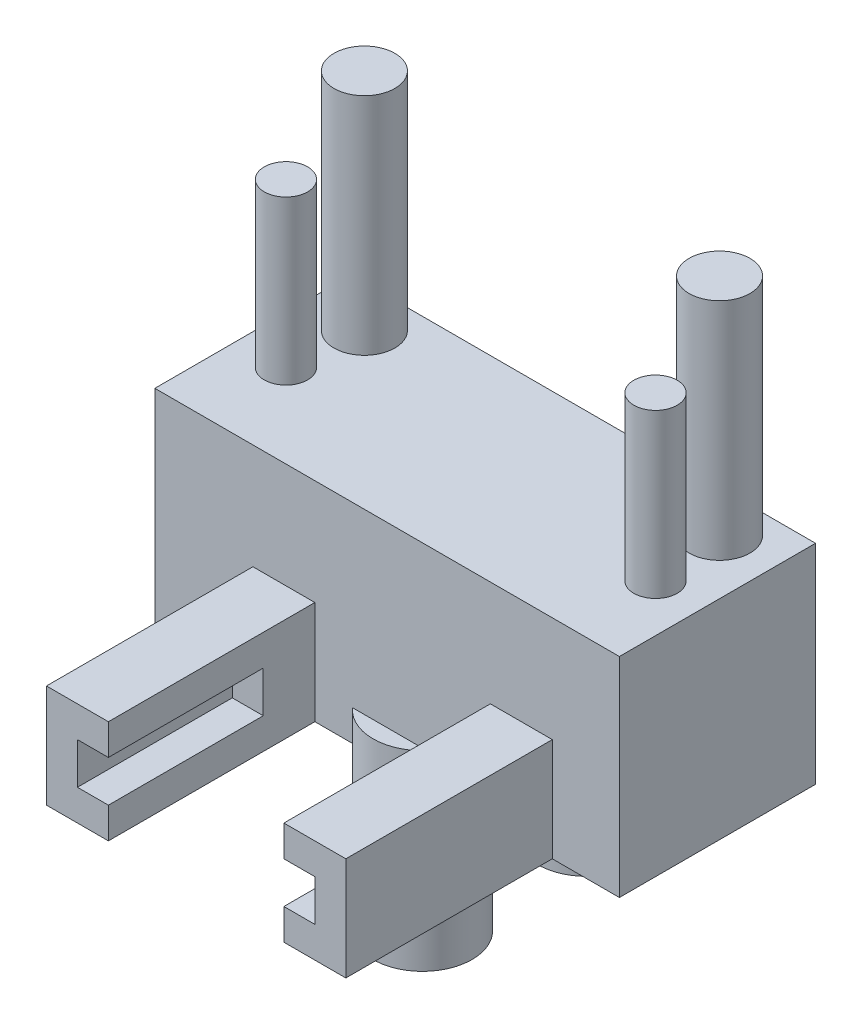
ISO-10303-21;
HEADER;
FILE_DESCRIPTION(('STEP AP214'),'2;1');
FILE_NAME('part.step','',(''),(''),'','','');
FILE_SCHEMA(('AUTOMOTIVE_DESIGN { 1 0 10303 214 1 1 1 1 }'));
ENDSEC;
DATA;
#1=APPLICATION_CONTEXT('core data for automotive mechanical design processes');
#2=APPLICATION_PROTOCOL_DEFINITION('international standard','automotive_design',2000,#1);
#3=PRODUCT_CONTEXT('',#1,'mechanical');
#4=PRODUCT('Part','Part','',(#3));
#5=PRODUCT_RELATED_PRODUCT_CATEGORY('part','',(#4));
#6=PRODUCT_DEFINITION_FORMATION('','',#4);
#7=PRODUCT_DEFINITION_CONTEXT('part definition',#1,'design');
#8=PRODUCT_DEFINITION('design','',#6,#7);
#9=PRODUCT_DEFINITION_SHAPE('','',#8);
#10=(LENGTH_UNIT() NAMED_UNIT(*) SI_UNIT(.MILLI.,.METRE.));
#11=(NAMED_UNIT(*) PLANE_ANGLE_UNIT() SI_UNIT($,.RADIAN.));
#12=(NAMED_UNIT(*) SI_UNIT($,.STERADIAN.) SOLID_ANGLE_UNIT());
#13=UNCERTAINTY_MEASURE_WITH_UNIT(LENGTH_MEASURE(1.E-05),#10,'distance_accuracy_value','');
#14=(GEOMETRIC_REPRESENTATION_CONTEXT(3) GLOBAL_UNCERTAINTY_ASSIGNED_CONTEXT((#13)) GLOBAL_UNIT_ASSIGNED_CONTEXT((#10,
#11,#12)) REPRESENTATION_CONTEXT('',''));
#15=CARTESIAN_POINT('',(0.,0.,0.));
#16=DIRECTION('',(0.,0.,1.));
#17=DIRECTION('',(1.,0.,0.));
#18=AXIS2_PLACEMENT_3D('',#15,#16,#17);
#19=CARTESIAN_POINT('',(-40.1857896698205,1.5,24.5794807115573));
#20=DIRECTION('',(1.,0.,0.));
#21=DIRECTION('',(0.,0.,-1.));
#22=AXIS2_PLACEMENT_3D('',#19,#20,#21);
#23=PLANE('',#22);
#24=DIRECTION('',(0.,-1.,0.));
#25=VECTOR('',#24,1.);
#26=CARTESIAN_POINT('',(-40.1857896698205,1.5,17.5794807115573));
#27=LINE('',#26,#25);
#28=CARTESIAN_POINT('',(-40.1857896698205,4.11,17.5794807115573));
#29=VERTEX_POINT('',#28);
#30=CARTESIAN_POINT('',(-40.1857896698205,-6.,17.5794807115573));
#31=VERTEX_POINT('',#30);
#32=EDGE_CURVE('E230',#29,#31,#27,.T.);
#33=ORIENTED_EDGE('',*,*,#32,.T.);
#34=DIRECTION('',(0.,0.,1.));
#35=VECTOR('',#34,1.);
#36=CARTESIAN_POINT('',(-40.1857896698205,-6.,0.));
#37=LINE('',#36,#35);
#38=CARTESIAN_POINT('',(-40.1857896698205,-6.,27.0794807115573));
#39=VERTEX_POINT('',#38);
#40=EDGE_CURVE('E199',#31,#39,#37,.T.);
#41=ORIENTED_EDGE('',*,*,#40,.T.);
#42=DIRECTION('',(0.,-1.,0.));
#43=VECTOR('',#42,1.);
#44=CARTESIAN_POINT('',(-40.1857896698205,1.5,27.0794807115573));
#45=LINE('',#44,#43);
#46=CARTESIAN_POINT('',(-40.1857896698205,4.11,27.0794807115573));
#47=VERTEX_POINT('',#46);
#48=EDGE_CURVE('E244',#47,#39,#45,.T.);
#49=ORIENTED_EDGE('',*,*,#48,.F.);
#50=DIRECTION('',(0.,0.,1.));
#51=VECTOR('',#50,1.);
#52=CARTESIAN_POINT('',(-40.1857896698205,4.11,17.5794807115573));
#53=LINE('',#52,#51);
#54=EDGE_CURVE('E384',#29,#47,#53,.T.);
#55=ORIENTED_EDGE('',*,*,#54,.F.);
#56=EDGE_LOOP('',(#33,#41,#49,#55));
#57=FACE_BOUND('',#56,.T.);
#58=ADVANCED_FACE('F37',(#57),#23,.F.);
#59=CARTESIAN_POINT('',(-17.6857896698205,1.5,24.5794807115573));
#60=DIRECTION('',(-1.,0.,0.));
#61=DIRECTION('',(0.,0.,1.));
#62=AXIS2_PLACEMENT_3D('',#59,#60,#61);
#63=PLANE('',#62);
#64=DIRECTION('',(0.,-1.,0.));
#65=VECTOR('',#64,1.);
#66=CARTESIAN_POINT('',(-17.6857896698205,1.5,17.5794807115573));
#67=LINE('',#66,#65);
#68=CARTESIAN_POINT('',(-17.6857896698205,4.11,17.5794807115573));
#69=VERTEX_POINT('',#68);
#70=CARTESIAN_POINT('',(-17.6857896698205,-6.,17.5794807115573));
#71=VERTEX_POINT('',#70);
#72=EDGE_CURVE('E227',#69,#71,#67,.T.);
#73=ORIENTED_EDGE('',*,*,#72,.F.);
#74=DIRECTION('',(0.,0.,-1.));
#75=VECTOR('',#74,1.);
#76=CARTESIAN_POINT('',(-17.6857896698205,4.11,17.5794807115573));
#77=LINE('',#76,#75);
#78=CARTESIAN_POINT('',(-17.6857896698205,4.11,27.0794807115573));
#79=VERTEX_POINT('',#78);
#80=EDGE_CURVE('E378',#79,#69,#77,.T.);
#81=ORIENTED_EDGE('',*,*,#80,.F.);
#82=DIRECTION('',(0.,-1.,0.));
#83=VECTOR('',#82,1.);
#84=CARTESIAN_POINT('',(-17.6857896698205,1.5,27.0794807115573));
#85=LINE('',#84,#83);
#86=CARTESIAN_POINT('',(-17.6857896698205,-6.,27.0794807115573));
#87=VERTEX_POINT('',#86);
#88=EDGE_CURVE('E245',#79,#87,#85,.T.);
#89=ORIENTED_EDGE('',*,*,#88,.T.);
#90=DIRECTION('',(0.,0.,1.));
#91=VECTOR('',#90,1.);
#92=CARTESIAN_POINT('',(-17.6857896698205,-6.,0.));
#93=LINE('',#92,#91);
#94=EDGE_CURVE('E200',#71,#87,#93,.T.);
#95=ORIENTED_EDGE('',*,*,#94,.F.);
#96=EDGE_LOOP('',(#73,#81,#89,#95));
#97=FACE_BOUND('',#96,.T.);
#98=ADVANCED_FACE('F420',(#97),#63,.F.);
#99=CARTESIAN_POINT('',(-40.1857896698205,1.5,17.5794807115573));
#100=DIRECTION('',(0.,0.,1.));
#101=DIRECTION('',(1.,0.,0.));
#102=AXIS2_PLACEMENT_3D('',#99,#100,#101);
#103=PLANE('',#102);
#104=DIRECTION('',(1.,0.,0.));
#105=VECTOR('',#104,1.);
#106=CARTESIAN_POINT('',(-40.1857896698205,-4.5,17.5794807115573));
#107=LINE('',#106,#105);
#108=CARTESIAN_POINT('',(-31.2100395525964,-4.5,17.5794807115573));
#109=VERTEX_POINT('',#108);
#110=CARTESIAN_POINT('',(-26.4115397870447,-4.5,17.5794807115573));
#111=VERTEX_POINT('',#110);
#112=EDGE_CURVE('E11',#109,#111,#107,.T.);
#113=ORIENTED_EDGE('',*,*,#112,.F.);
#114=DIRECTION('',(0.,-1.,0.));
#115=VECTOR('',#114,1.);
#116=CARTESIAN_POINT('',(-31.2100395525964,-4.5,17.5794807115573));
#117=LINE('',#116,#115);
#118=CARTESIAN_POINT('',(-31.2100395525964,-6.,17.5794807115573));
#119=VERTEX_POINT('',#118);
#120=EDGE_CURVE('E203',#109,#119,#117,.T.);
#121=ORIENTED_EDGE('',*,*,#120,.T.);
#122=DIRECTION('',(1.,0.,0.));
#123=VECTOR('',#122,1.);
#124=CARTESIAN_POINT('',(0.,-6.,17.5794807115573));
#125=LINE('',#124,#123);
#126=EDGE_CURVE('E195',#31,#119,#125,.T.);
#127=ORIENTED_EDGE('',*,*,#126,.F.);
#128=ORIENTED_EDGE('',*,*,#32,.F.);
#129=DIRECTION('',(-1.,0.,0.));
#130=VECTOR('',#129,1.);
#131=CARTESIAN_POINT('',(-40.1857896698205,4.11,17.5794807115573));
#132=LINE('',#131,#130);
#133=EDGE_CURVE('E222',#69,#29,#132,.T.);
#134=ORIENTED_EDGE('',*,*,#133,.F.);
#135=ORIENTED_EDGE('',*,*,#72,.T.);
#136=CARTESIAN_POINT('',(-26.4115397870447,-6.,17.5794807115573));
#137=VERTEX_POINT('',#136);
#138=EDGE_CURVE('E201',#137,#71,#125,.T.);
#139=ORIENTED_EDGE('',*,*,#138,.F.);
#140=DIRECTION('',(0.,-1.,0.));
#141=VECTOR('',#140,1.);
#142=CARTESIAN_POINT('',(-26.4115397870447,-4.5,17.5794807115573));
#143=LINE('',#142,#141);
#144=EDGE_CURVE('E51',#137,#111,#143,.F.);
#145=ORIENTED_EDGE('',*,*,#144,.T.);
#146=EDGE_LOOP('',(#113,#121,#127,#128,#134,#135,#139,#145));
#147=FACE_BOUND('',#146,.T.);
#148=ADVANCED_FACE('F204',(#147),#103,.F.);
#149=CARTESIAN_POINT('',(0.,1.5,27.0794807115573));
#150=DIRECTION('',(0.,0.,1.));
#151=DIRECTION('',(1.,0.,0.));
#152=AXIS2_PLACEMENT_3D('',#149,#150,#151);
#153=PLANE('',#152);
#154=DIRECTION('',(0.,-1.,0.));
#155=VECTOR('',#154,1.);
#156=CARTESIAN_POINT('',(-30.60853826181,-4.5,27.0794807115573));
#157=LINE('',#156,#155);
#158=CARTESIAN_POINT('',(-30.60853826181,-4.5,27.0794807115573));
#159=VERTEX_POINT('',#158);
#160=CARTESIAN_POINT('',(-30.60853826181,-6.,27.0794807115573));
#161=VERTEX_POINT('',#160);
#162=EDGE_CURVE('E387',#159,#161,#157,.T.);
#163=ORIENTED_EDGE('',*,*,#162,.F.);
#164=DIRECTION('',(1.,0.,0.));
#165=VECTOR('',#164,1.);
#166=CARTESIAN_POINT('',(0.,-4.5,27.0794807115573));
#167=LINE('',#166,#165);
#168=CARTESIAN_POINT('',(-27.0130410778311,-4.5,27.0794807115573));
#169=VERTEX_POINT('',#168);
#170=EDGE_CURVE('E211',#159,#169,#167,.T.);
#171=ORIENTED_EDGE('',*,*,#170,.T.);
#172=DIRECTION('',(0.,-1.,0.));
#173=VECTOR('',#172,1.);
#174=CARTESIAN_POINT('',(-27.0130410778311,-4.5,27.0794807115573));
#175=LINE('',#174,#173);
#176=CARTESIAN_POINT('',(-27.0130410778311,-6.,27.0794807115573));
#177=VERTEX_POINT('',#176);
#178=EDGE_CURVE('E390',#177,#169,#175,.F.);
#179=ORIENTED_EDGE('',*,*,#178,.F.);
#180=DIRECTION('',(-1.,0.,0.));
#181=VECTOR('',#180,1.);
#182=CARTESIAN_POINT('',(0.,-6.,27.0794807115573));
#183=LINE('',#182,#181);
#184=CARTESIAN_POINT('',(-23.9357896698205,-6.,27.0794807115573));
#185=VERTEX_POINT('',#184);
#186=EDGE_CURVE('E252',#185,#177,#183,.T.);
#187=ORIENTED_EDGE('',*,*,#186,.F.);
#188=DIRECTION('',(0.,-1.,0.));
#189=VECTOR('',#188,1.);
#190=CARTESIAN_POINT('',(-23.9357896698205,-1.,27.0794807115573));
#191=LINE('',#190,#189);
#192=CARTESIAN_POINT('',(-23.9357896698205,-1.,27.0794807115573));
#193=VERTEX_POINT('',#192);
#194=EDGE_CURVE('E291',#193,#185,#191,.T.);
#195=ORIENTED_EDGE('',*,*,#194,.F.);
#196=DIRECTION('',(1.,0.,0.));
#197=VECTOR('',#196,1.);
#198=CARTESIAN_POINT('',(-23.9357896698205,-1.,27.0794807115573));
#199=LINE('',#198,#197);
#200=CARTESIAN_POINT('',(-20.9357896698205,-1.,27.0794807115573));
#201=VERTEX_POINT('',#200);
#202=EDGE_CURVE('E318',#193,#201,#199,.T.);
#203=ORIENTED_EDGE('',*,*,#202,.T.);
#204=DIRECTION('',(0.,-1.,0.));
#205=VECTOR('',#204,1.);
#206=CARTESIAN_POINT('',(-20.9357896698205,-1.,27.0794807115573));
#207=LINE('',#206,#205);
#208=CARTESIAN_POINT('',(-20.9357896698205,-6.,27.0794807115573));
#209=VERTEX_POINT('',#208);
#210=EDGE_CURVE('E294',#201,#209,#207,.T.);
#211=ORIENTED_EDGE('',*,*,#210,.T.);
#212=EDGE_CURVE('E247',#87,#209,#183,.T.);
#213=ORIENTED_EDGE('',*,*,#212,.F.);
#214=ORIENTED_EDGE('',*,*,#88,.F.);
#215=DIRECTION('',(1.,0.,0.));
#216=VECTOR('',#215,1.);
#217=CARTESIAN_POINT('',(-40.1857896698205,4.11,27.0794807115573));
#218=LINE('',#217,#216);
#219=EDGE_CURVE('E381',#47,#79,#218,.T.);
#220=ORIENTED_EDGE('',*,*,#219,.F.);
#221=ORIENTED_EDGE('',*,*,#48,.T.);
#222=CARTESIAN_POINT('',(-35.4357896698205,-6.,27.0794807115573));
#223=VERTEX_POINT('',#222);
#224=EDGE_CURVE('E254',#223,#39,#183,.T.);
#225=ORIENTED_EDGE('',*,*,#224,.F.);
#226=DIRECTION('',(0.,-1.,0.));
#227=VECTOR('',#226,1.);
#228=CARTESIAN_POINT('',(-35.4357896698205,-1.,27.0794807115573));
#229=LINE('',#228,#227);
#230=CARTESIAN_POINT('',(-35.4357896698205,-1.,27.0794807115573));
#231=VERTEX_POINT('',#230);
#232=EDGE_CURVE('E259',#231,#223,#229,.T.);
#233=ORIENTED_EDGE('',*,*,#232,.F.);
#234=DIRECTION('',(1.,0.,0.));
#235=VECTOR('',#234,1.);
#236=CARTESIAN_POINT('',(-35.4357896698205,-1.,27.0794807115573));
#237=LINE('',#236,#235);
#238=CARTESIAN_POINT('',(-32.4357896698205,-1.,27.0794807115573));
#239=VERTEX_POINT('',#238);
#240=EDGE_CURVE('E286',#231,#239,#237,.T.);
#241=ORIENTED_EDGE('',*,*,#240,.T.);
#242=DIRECTION('',(0.,-1.,0.));
#243=VECTOR('',#242,1.);
#244=CARTESIAN_POINT('',(-32.4357896698205,-1.,27.0794807115573));
#245=LINE('',#244,#243);
#246=CARTESIAN_POINT('',(-32.4357896698205,-6.,27.0794807115573));
#247=VERTEX_POINT('',#246);
#248=EDGE_CURVE('E261',#239,#247,#245,.T.);
#249=ORIENTED_EDGE('',*,*,#248,.T.);
#250=EDGE_CURVE('E253',#161,#247,#183,.T.);
#251=ORIENTED_EDGE('',*,*,#250,.F.);
#252=EDGE_LOOP('',(#163,#171,#179,#187,#195,#203,#211,#213,#214,#220,#221,#225,#233,#241,#249,#251));
#253=FACE_BOUND('',#252,.T.);
#254=ADVANCED_FACE('F435',(#253),#153,.T.);
#255=CARTESIAN_POINT('',(0.,-6.,0.));
#256=DIRECTION('',(0.,-1.,0.));
#257=DIRECTION('',(0.,0.,-1.));
#258=AXIS2_PLACEMENT_3D('',#255,#256,#257);
#259=PLANE('',#258);
#260=CARTESIAN_POINT('',(-28.8107896698205,-6.,17.5194807115573));
#261=DIRECTION('',(0.,-1.,0.));
#262=DIRECTION('',(0.,0.,-1.));
#263=AXIS2_PLACEMENT_3D('',#260,#261,#262);
#264=CIRCLE('',#263,2.4);
#265=EDGE_CURVE('E44',#137,#119,#264,.T.);
#266=ORIENTED_EDGE('',*,*,#265,.F.);
#267=ORIENTED_EDGE('',*,*,#138,.T.);
#268=ORIENTED_EDGE('',*,*,#94,.T.);
#269=ORIENTED_EDGE('',*,*,#212,.T.);
#270=DIRECTION('',(0.,0.,1.));
#271=VECTOR('',#270,1.);
#272=CARTESIAN_POINT('',(-20.9357896698205,-6.,27.0794807115573));
#273=LINE('',#272,#271);
#274=CARTESIAN_POINT('',(-20.9357896698205,-6.,37.0794807115573));
#275=VERTEX_POINT('',#274);
#276=EDGE_CURVE('E307',#209,#275,#273,.T.);
#277=ORIENTED_EDGE('',*,*,#276,.T.);
#278=DIRECTION('',(-1.,0.,0.));
#279=VECTOR('',#278,1.);
#280=CARTESIAN_POINT('',(-23.9357896698205,-6.,37.0794807115573));
#281=LINE('',#280,#279);
#282=CARTESIAN_POINT('',(-23.9357896698205,-6.,37.0794807115573));
#283=VERTEX_POINT('',#282);
#284=EDGE_CURVE('E303',#275,#283,#281,.T.);
#285=ORIENTED_EDGE('',*,*,#284,.T.);
#286=DIRECTION('',(0.,0.,-1.));
#287=VECTOR('',#286,1.);
#288=CARTESIAN_POINT('',(-23.9357896698205,-6.,27.0794807115573));
#289=LINE('',#288,#287);
#290=EDGE_CURVE('E310',#283,#185,#289,.T.);
#291=ORIENTED_EDGE('',*,*,#290,.T.);
#292=ORIENTED_EDGE('',*,*,#186,.T.);
#293=CARTESIAN_POINT('',(-28.8107896698205,-6.,25.4894807115573));
#294=DIRECTION('',(0.,-1.,0.));
#295=DIRECTION('',(0.,0.,-1.));
#296=AXIS2_PLACEMENT_3D('',#293,#294,#295);
#297=CIRCLE('',#296,2.4);
#298=EDGE_CURVE('E212',#161,#177,#297,.T.);
#299=ORIENTED_EDGE('',*,*,#298,.F.);
#300=ORIENTED_EDGE('',*,*,#250,.T.);
#301=DIRECTION('',(0.,0.,1.));
#302=VECTOR('',#301,1.);
#303=CARTESIAN_POINT('',(-32.4357896698205,-6.,27.0794807115573));
#304=LINE('',#303,#302);
#305=CARTESIAN_POINT('',(-32.4357896698205,-6.,37.0794807115573));
#306=VERTEX_POINT('',#305);
#307=EDGE_CURVE('E274',#247,#306,#304,.T.);
#308=ORIENTED_EDGE('',*,*,#307,.T.);
#309=DIRECTION('',(-1.,0.,0.));
#310=VECTOR('',#309,1.);
#311=CARTESIAN_POINT('',(-35.4357896698205,-6.,37.0794807115573));
#312=LINE('',#311,#310);
#313=CARTESIAN_POINT('',(-35.4357896698205,-6.,37.0794807115573));
#314=VERTEX_POINT('',#313);
#315=EDGE_CURVE('E270',#306,#314,#312,.T.);
#316=ORIENTED_EDGE('',*,*,#315,.T.);
#317=DIRECTION('',(0.,0.,-1.));
#318=VECTOR('',#317,1.);
#319=CARTESIAN_POINT('',(-35.4357896698205,-6.,27.0794807115573));
#320=LINE('',#319,#318);
#321=EDGE_CURVE('E277',#314,#223,#320,.T.);
#322=ORIENTED_EDGE('',*,*,#321,.T.);
#323=ORIENTED_EDGE('',*,*,#224,.T.);
#324=ORIENTED_EDGE('',*,*,#40,.F.);
#325=ORIENTED_EDGE('',*,*,#126,.T.);
#326=EDGE_LOOP('',(#266,#267,#268,#269,#277,#285,#291,#292,#299,#300,#308,#316,#322,#323,#324,#325));
#327=FACE_BOUND('',#326,.T.);
#328=ADVANCED_FACE('F196',(#327),#259,.T.);
#329=CARTESIAN_POINT('',(-35.4357896698205,-1.,27.0794807115573));
#330=DIRECTION('',(-1.,0.,0.));
#331=DIRECTION('',(0.,0.,1.));
#332=AXIS2_PLACEMENT_3D('',#329,#330,#331);
#333=PLANE('',#332);
#334=ORIENTED_EDGE('',*,*,#321,.F.);
#335=DIRECTION('',(0.,-1.,0.));
#336=VECTOR('',#335,1.);
#337=CARTESIAN_POINT('',(-35.4357896698205,-1.,37.0794807115573));
#338=LINE('',#337,#336);
#339=CARTESIAN_POINT('',(-35.4357896698205,-1.,37.0794807115573));
#340=VERTEX_POINT('',#339);
#341=EDGE_CURVE('E258',#340,#314,#338,.T.);
#342=ORIENTED_EDGE('',*,*,#341,.F.);
#343=DIRECTION('',(0.,0.,-1.));
#344=VECTOR('',#343,1.);
#345=CARTESIAN_POINT('',(-35.4357896698205,-1.,27.0794807115573));
#346=LINE('',#345,#344);
#347=EDGE_CURVE('E273',#340,#231,#346,.T.);
#348=ORIENTED_EDGE('',*,*,#347,.T.);
#349=ORIENTED_EDGE('',*,*,#232,.T.);
#350=EDGE_LOOP('',(#334,#342,#348,#349));
#351=FACE_BOUND('',#350,.T.);
#352=ADVANCED_FACE('F460',(#351),#333,.T.);
#353=CARTESIAN_POINT('',(-35.4357896698205,-1.,37.0794807115573));
#354=DIRECTION('',(0.,0.,1.));
#355=DIRECTION('',(1.,0.,0.));
#356=AXIS2_PLACEMENT_3D('',#353,#354,#355);
#357=PLANE('',#356);
#358=DIRECTION('',(1.,0.,0.));
#359=VECTOR('',#358,1.);
#360=CARTESIAN_POINT('',(-22.4357896698205,-4.5,37.0794807115573));
#361=LINE('',#360,#359);
#362=CARTESIAN_POINT('',(-33.9357896698205,-4.5,37.0794807115573));
#363=VERTEX_POINT('',#362);
#364=CARTESIAN_POINT('',(-32.4357896698205,-4.5,37.0794807115573));
#365=VERTEX_POINT('',#364);
#366=EDGE_CURVE('E346',#363,#365,#361,.T.);
#367=ORIENTED_EDGE('',*,*,#366,.F.);
#368=DIRECTION('',(0.,-1.,0.));
#369=VECTOR('',#368,1.);
#370=CARTESIAN_POINT('',(-33.9357896698205,-4.5,37.0794807115573));
#371=LINE('',#370,#369);
#372=CARTESIAN_POINT('',(-33.9357896698205,-2.5,37.0794807115573));
#373=VERTEX_POINT('',#372);
#374=EDGE_CURVE('E349',#373,#363,#371,.T.);
#375=ORIENTED_EDGE('',*,*,#374,.F.);
#376=DIRECTION('',(-1.,0.,0.));
#377=VECTOR('',#376,1.);
#378=CARTESIAN_POINT('',(-22.4357896698205,-2.5,37.0794807115573));
#379=LINE('',#378,#377);
#380=CARTESIAN_POINT('',(-32.4357896698205,-2.5,37.0794807115573));
#381=VERTEX_POINT('',#380);
#382=EDGE_CURVE('E354',#381,#373,#379,.T.);
#383=ORIENTED_EDGE('',*,*,#382,.F.);
#384=DIRECTION('',(0.,-1.,0.));
#385=VECTOR('',#384,1.);
#386=CARTESIAN_POINT('',(-32.4357896698205,-1.,37.0794807115573));
#387=LINE('',#386,#385);
#388=CARTESIAN_POINT('',(-32.4357896698205,-1.,37.0794807115573));
#389=VERTEX_POINT('',#388);
#390=EDGE_CURVE('E266',#389,#381,#387,.T.);
#391=ORIENTED_EDGE('',*,*,#390,.F.);
#392=DIRECTION('',(-1.,0.,0.));
#393=VECTOR('',#392,1.);
#394=CARTESIAN_POINT('',(-35.4357896698205,-1.,37.0794807115573));
#395=LINE('',#394,#393);
#396=EDGE_CURVE('E262',#389,#340,#395,.T.);
#397=ORIENTED_EDGE('',*,*,#396,.T.);
#398=ORIENTED_EDGE('',*,*,#341,.T.);
#399=ORIENTED_EDGE('',*,*,#315,.F.);
#400=EDGE_CURVE('E265',#365,#306,#387,.T.);
#401=ORIENTED_EDGE('',*,*,#400,.F.);
#402=EDGE_LOOP('',(#367,#375,#383,#391,#397,#398,#399,#401));
#403=FACE_BOUND('',#402,.T.);
#404=ADVANCED_FACE('F468',(#403),#357,.T.);
#405=CARTESIAN_POINT('',(-32.4357896698205,-1.,27.0794807115573));
#406=DIRECTION('',(1.,0.,0.));
#407=DIRECTION('',(0.,0.,-1.));
#408=AXIS2_PLACEMENT_3D('',#405,#406,#407);
#409=PLANE('',#408);
#410=DIRECTION('',(0.,0.,-1.));
#411=VECTOR('',#410,1.);
#412=CARTESIAN_POINT('',(-32.4357896698205,-4.5,27.0794807115573));
#413=LINE('',#412,#411);
#414=CARTESIAN_POINT('',(-32.4357896698205,-4.5,29.5794807115573));
#415=VERTEX_POINT('',#414);
#416=EDGE_CURVE('E325',#365,#415,#413,.T.);
#417=ORIENTED_EDGE('',*,*,#416,.F.);
#418=ORIENTED_EDGE('',*,*,#400,.T.);
#419=ORIENTED_EDGE('',*,*,#307,.F.);
#420=ORIENTED_EDGE('',*,*,#248,.F.);
#421=DIRECTION('',(0.,0.,1.));
#422=VECTOR('',#421,1.);
#423=CARTESIAN_POINT('',(-32.4357896698205,-1.,27.0794807115573));
#424=LINE('',#423,#422);
#425=EDGE_CURVE('E283',#239,#389,#424,.T.);
#426=ORIENTED_EDGE('',*,*,#425,.T.);
#427=ORIENTED_EDGE('',*,*,#390,.T.);
#428=DIRECTION('',(0.,0.,1.));
#429=VECTOR('',#428,1.);
#430=CARTESIAN_POINT('',(-32.4357896698205,-2.5,27.0794807115573));
#431=LINE('',#430,#429);
#432=CARTESIAN_POINT('',(-32.4357896698205,-2.5,29.5794807115573));
#433=VERTEX_POINT('',#432);
#434=EDGE_CURVE('E330',#433,#381,#431,.T.);
#435=ORIENTED_EDGE('',*,*,#434,.F.);
#436=DIRECTION('',(0.,-1.,0.));
#437=VECTOR('',#436,1.);
#438=CARTESIAN_POINT('',(-32.4357896698205,-1.,29.5794807115573));
#439=LINE('',#438,#437);
#440=EDGE_CURVE('E312',#433,#415,#439,.T.);
#441=ORIENTED_EDGE('',*,*,#440,.T.);
#442=EDGE_LOOP('',(#417,#418,#419,#420,#426,#427,#435,#441));
#443=FACE_BOUND('',#442,.T.);
#444=ADVANCED_FACE('F475',(#443),#409,.T.);
#445=CARTESIAN_POINT('',(0.,-1.,0.));
#446=DIRECTION('',(0.,1.,0.));
#447=DIRECTION('',(0.,0.,1.));
#448=AXIS2_PLACEMENT_3D('',#445,#446,#447);
#449=PLANE('',#448);
#450=ORIENTED_EDGE('',*,*,#347,.F.);
#451=ORIENTED_EDGE('',*,*,#396,.F.);
#452=ORIENTED_EDGE('',*,*,#425,.F.);
#453=ORIENTED_EDGE('',*,*,#240,.F.);
#454=EDGE_LOOP('',(#450,#451,#452,#453));
#455=FACE_BOUND('',#454,.T.);
#456=ADVANCED_FACE('F464',(#455),#449,.T.);
#457=CARTESIAN_POINT('',(-23.9357896698205,-1.,27.0794807115573));
#458=DIRECTION('',(-1.,0.,0.));
#459=DIRECTION('',(0.,0.,1.));
#460=AXIS2_PLACEMENT_3D('',#457,#458,#459);
#461=PLANE('',#460);
#462=DIRECTION('',(0.,0.,1.));
#463=VECTOR('',#462,1.);
#464=CARTESIAN_POINT('',(-23.9357896698205,-4.5,27.0794807115573));
#465=LINE('',#464,#463);
#466=CARTESIAN_POINT('',(-23.9357896698205,-4.5,29.5794807115573));
#467=VERTEX_POINT('',#466);
#468=CARTESIAN_POINT('',(-23.9357896698205,-4.5,37.0794807115573));
#469=VERTEX_POINT('',#468);
#470=EDGE_CURVE('E328',#467,#469,#465,.T.);
#471=ORIENTED_EDGE('',*,*,#470,.F.);
#472=DIRECTION('',(0.,1.,0.));
#473=VECTOR('',#472,1.);
#474=CARTESIAN_POINT('',(-23.9357896698205,-1.,29.5794807115573));
#475=LINE('',#474,#473);
#476=CARTESIAN_POINT('',(-23.9357896698205,-2.5,29.5794807115573));
#477=VERTEX_POINT('',#476);
#478=EDGE_CURVE('E217',#467,#477,#475,.T.);
#479=ORIENTED_EDGE('',*,*,#478,.T.);
#480=DIRECTION('',(0.,0.,-1.));
#481=VECTOR('',#480,1.);
#482=CARTESIAN_POINT('',(-23.9357896698205,-2.5,27.0794807115573));
#483=LINE('',#482,#481);
#484=CARTESIAN_POINT('',(-23.9357896698205,-2.5,37.0794807115573));
#485=VERTEX_POINT('',#484);
#486=EDGE_CURVE('E332',#485,#477,#483,.T.);
#487=ORIENTED_EDGE('',*,*,#486,.F.);
#488=DIRECTION('',(0.,-1.,0.));
#489=VECTOR('',#488,1.);
#490=CARTESIAN_POINT('',(-23.9357896698205,-1.,37.0794807115573));
#491=LINE('',#490,#489);
#492=CARTESIAN_POINT('',(-23.9357896698205,-1.,37.0794807115573));
#493=VERTEX_POINT('',#492);
#494=EDGE_CURVE('E280',#493,#485,#491,.T.);
#495=ORIENTED_EDGE('',*,*,#494,.F.);
#496=DIRECTION('',(0.,0.,-1.));
#497=VECTOR('',#496,1.);
#498=CARTESIAN_POINT('',(-23.9357896698205,-1.,27.0794807115573));
#499=LINE('',#498,#497);
#500=EDGE_CURVE('E306',#493,#193,#499,.T.);
#501=ORIENTED_EDGE('',*,*,#500,.T.);
#502=ORIENTED_EDGE('',*,*,#194,.T.);
#503=ORIENTED_EDGE('',*,*,#290,.F.);
#504=EDGE_CURVE('E300',#469,#283,#491,.T.);
#505=ORIENTED_EDGE('',*,*,#504,.F.);
#506=EDGE_LOOP('',(#471,#479,#487,#495,#501,#502,#503,#505));
#507=FACE_BOUND('',#506,.T.);
#508=ADVANCED_FACE('F455',(#507),#461,.T.);
#509=CARTESIAN_POINT('',(-23.9357896698205,-1.,37.0794807115573));
#510=DIRECTION('',(0.,0.,1.));
#511=DIRECTION('',(1.,0.,0.));
#512=AXIS2_PLACEMENT_3D('',#509,#510,#511);
#513=PLANE('',#512);
#514=DIRECTION('',(1.,0.,0.));
#515=VECTOR('',#514,1.);
#516=CARTESIAN_POINT('',(-23.9357896698205,-4.5,37.0794807115573));
#517=LINE('',#516,#515);
#518=CARTESIAN_POINT('',(-22.4357896698205,-4.5,37.0794807115573));
#519=VERTEX_POINT('',#518);
#520=EDGE_CURVE('E225',#469,#519,#517,.T.);
#521=ORIENTED_EDGE('',*,*,#520,.F.);
#522=ORIENTED_EDGE('',*,*,#504,.T.);
#523=ORIENTED_EDGE('',*,*,#284,.F.);
#524=DIRECTION('',(0.,-1.,0.));
#525=VECTOR('',#524,1.);
#526=CARTESIAN_POINT('',(-20.9357896698205,-1.,37.0794807115573));
#527=LINE('',#526,#525);
#528=CARTESIAN_POINT('',(-20.9357896698205,-1.,37.0794807115573));
#529=VERTEX_POINT('',#528);
#530=EDGE_CURVE('E298',#529,#275,#527,.T.);
#531=ORIENTED_EDGE('',*,*,#530,.F.);
#532=DIRECTION('',(-1.,0.,0.));
#533=VECTOR('',#532,1.);
#534=CARTESIAN_POINT('',(-23.9357896698205,-1.,37.0794807115573));
#535=LINE('',#534,#533);
#536=EDGE_CURVE('E295',#529,#493,#535,.T.);
#537=ORIENTED_EDGE('',*,*,#536,.T.);
#538=ORIENTED_EDGE('',*,*,#494,.T.);
#539=CARTESIAN_POINT('',(-22.4357896698205,-2.5,37.0794807115573));
#540=VERTEX_POINT('',#539);
#541=EDGE_CURVE('E352',#540,#485,#379,.T.);
#542=ORIENTED_EDGE('',*,*,#541,.F.);
#543=DIRECTION('',(0.,1.,0.));
#544=VECTOR('',#543,1.);
#545=CARTESIAN_POINT('',(-22.4357896698205,-4.5,37.0794807115573));
#546=LINE('',#545,#544);
#547=EDGE_CURVE('E355',#519,#540,#546,.T.);
#548=ORIENTED_EDGE('',*,*,#547,.F.);
#549=EDGE_LOOP('',(#521,#522,#523,#531,#537,#538,#542,#548));
#550=FACE_BOUND('',#549,.T.);
#551=ADVANCED_FACE('F446',(#550),#513,.T.);
#552=CARTESIAN_POINT('',(-20.9357896698205,-1.,27.0794807115573));
#553=DIRECTION('',(1.,0.,0.));
#554=DIRECTION('',(0.,0.,-1.));
#555=AXIS2_PLACEMENT_3D('',#552,#553,#554);
#556=PLANE('',#555);
#557=ORIENTED_EDGE('',*,*,#276,.F.);
#558=ORIENTED_EDGE('',*,*,#210,.F.);
#559=DIRECTION('',(0.,0.,1.));
#560=VECTOR('',#559,1.);
#561=CARTESIAN_POINT('',(-20.9357896698205,-1.,27.0794807115573));
#562=LINE('',#561,#560);
#563=EDGE_CURVE('E315',#201,#529,#562,.T.);
#564=ORIENTED_EDGE('',*,*,#563,.T.);
#565=ORIENTED_EDGE('',*,*,#530,.T.);
#566=EDGE_LOOP('',(#557,#558,#564,#565));
#567=FACE_BOUND('',#566,.T.);
#568=ADVANCED_FACE('F439',(#567),#556,.T.);
#569=CARTESIAN_POINT('',(0.,-1.,0.));
#570=DIRECTION('',(0.,1.,0.));
#571=DIRECTION('',(0.,0.,1.));
#572=AXIS2_PLACEMENT_3D('',#569,#570,#571);
#573=PLANE('',#572);
#574=ORIENTED_EDGE('',*,*,#500,.F.);
#575=ORIENTED_EDGE('',*,*,#536,.F.);
#576=ORIENTED_EDGE('',*,*,#563,.F.);
#577=ORIENTED_EDGE('',*,*,#202,.F.);
#578=EDGE_LOOP('',(#574,#575,#576,#577));
#579=FACE_BOUND('',#578,.T.);
#580=ADVANCED_FACE('F443',(#579),#573,.T.);
#581=CARTESIAN_POINT('',(-22.4357896698205,-2.5,29.5794807115573));
#582=DIRECTION('',(0.,1.,0.));
#583=DIRECTION('',(-1.,0.,0.));
#584=AXIS2_PLACEMENT_3D('',#581,#582,#583);
#585=PLANE('',#584);
#586=ORIENTED_EDGE('',*,*,#486,.T.);
#587=DIRECTION('',(-1.,0.,0.));
#588=VECTOR('',#587,1.);
#589=CARTESIAN_POINT('',(-22.4357896698205,-2.5,29.5794807115573));
#590=LINE('',#589,#588);
#591=CARTESIAN_POINT('',(-22.4357896698205,-2.5,29.5794807115573));
#592=VERTEX_POINT('',#591);
#593=EDGE_CURVE('E363',#592,#477,#590,.T.);
#594=ORIENTED_EDGE('',*,*,#593,.F.);
#595=DIRECTION('',(0.,0.,1.));
#596=VECTOR('',#595,1.);
#597=CARTESIAN_POINT('',(-22.4357896698205,-2.5,29.5794807115573));
#598=LINE('',#597,#596);
#599=EDGE_CURVE('E335',#592,#540,#598,.T.);
#600=ORIENTED_EDGE('',*,*,#599,.T.);
#601=ORIENTED_EDGE('',*,*,#541,.T.);
#602=EDGE_LOOP('',(#586,#594,#600,#601));
#603=FACE_BOUND('',#602,.T.);
#604=ADVANCED_FACE('F509',(#603),#585,.F.);
#605=CARTESIAN_POINT('',(-22.4357896698205,-4.5,29.5794807115573));
#606=DIRECTION('',(0.,-1.,0.));
#607=DIRECTION('',(1.,0.,0.));
#608=AXIS2_PLACEMENT_3D('',#605,#606,#607);
#609=PLANE('',#608);
#610=ORIENTED_EDGE('',*,*,#470,.T.);
#611=ORIENTED_EDGE('',*,*,#520,.T.);
#612=DIRECTION('',(0.,0.,1.));
#613=VECTOR('',#612,1.);
#614=CARTESIAN_POINT('',(-22.4357896698205,-4.5,29.5794807115573));
#615=LINE('',#614,#613);
#616=CARTESIAN_POINT('',(-22.4357896698205,-4.5,29.5794807115573));
#617=VERTEX_POINT('',#616);
#618=EDGE_CURVE('E334',#617,#519,#615,.T.);
#619=ORIENTED_EDGE('',*,*,#618,.F.);
#620=DIRECTION('',(1.,0.,0.));
#621=VECTOR('',#620,1.);
#622=CARTESIAN_POINT('',(-22.4357896698205,-4.5,29.5794807115573));
#623=LINE('',#622,#621);
#624=EDGE_CURVE('E359',#467,#617,#623,.T.);
#625=ORIENTED_EDGE('',*,*,#624,.F.);
#626=EDGE_LOOP('',(#610,#611,#619,#625));
#627=FACE_BOUND('',#626,.T.);
#628=ADVANCED_FACE('F506',(#627),#609,.F.);
#629=CARTESIAN_POINT('',(-22.4357896698205,-4.5,29.5794807115573));
#630=DIRECTION('',(1.,0.,0.));
#631=DIRECTION('',(0.,0.,-1.));
#632=AXIS2_PLACEMENT_3D('',#629,#630,#631);
#633=PLANE('',#632);
#634=ORIENTED_EDGE('',*,*,#547,.T.);
#635=ORIENTED_EDGE('',*,*,#599,.F.);
#636=DIRECTION('',(0.,1.,0.));
#637=VECTOR('',#636,1.);
#638=CARTESIAN_POINT('',(-22.4357896698205,-4.5,29.5794807115573));
#639=LINE('',#638,#637);
#640=EDGE_CURVE('E348',#617,#592,#639,.T.);
#641=ORIENTED_EDGE('',*,*,#640,.F.);
#642=ORIENTED_EDGE('',*,*,#618,.T.);
#643=EDGE_LOOP('',(#634,#635,#641,#642));
#644=FACE_BOUND('',#643,.T.);
#645=ADVANCED_FACE('F504',(#644),#633,.F.);
#646=CARTESIAN_POINT('',(0.,0.,29.5794807115573));
#647=DIRECTION('',(0.,0.,1.));
#648=DIRECTION('',(1.,0.,0.));
#649=AXIS2_PLACEMENT_3D('',#646,#647,#648);
#650=PLANE('',#649);
#651=ORIENTED_EDGE('',*,*,#624,.T.);
#652=ORIENTED_EDGE('',*,*,#640,.T.);
#653=ORIENTED_EDGE('',*,*,#593,.T.);
#654=ORIENTED_EDGE('',*,*,#478,.F.);
#655=EDGE_LOOP('',(#651,#652,#653,#654));
#656=FACE_BOUND('',#655,.T.);
#657=ADVANCED_FACE('F500',(#656),#650,.T.);
#658=CARTESIAN_POINT('',(-33.9357896698205,-2.5,29.5794807115573));
#659=VERTEX_POINT('',#658);
#660=EDGE_CURVE('E366',#433,#659,#590,.T.);
#661=ORIENTED_EDGE('',*,*,#660,.T.);
#662=DIRECTION('',(0.,-1.,0.));
#663=VECTOR('',#662,1.);
#664=CARTESIAN_POINT('',(-33.9357896698205,-4.5,29.5794807115573));
#665=LINE('',#664,#663);
#666=CARTESIAN_POINT('',(-33.9357896698205,-4.5,29.5794807115573));
#667=VERTEX_POINT('',#666);
#668=EDGE_CURVE('E360',#659,#667,#665,.T.);
#669=ORIENTED_EDGE('',*,*,#668,.T.);
#670=EDGE_CURVE('E339',#667,#415,#623,.T.);
#671=ORIENTED_EDGE('',*,*,#670,.T.);
#672=ORIENTED_EDGE('',*,*,#440,.F.);
#673=EDGE_LOOP('',(#661,#669,#671,#672));
#674=FACE_BOUND('',#673,.T.);
#675=ADVANCED_FACE('F503',(#674),#650,.T.);
#676=ORIENTED_EDGE('',*,*,#416,.T.);
#677=ORIENTED_EDGE('',*,*,#670,.F.);
#678=DIRECTION('',(0.,0.,1.));
#679=VECTOR('',#678,1.);
#680=CARTESIAN_POINT('',(-33.9357896698205,-4.5,29.5794807115573));
#681=LINE('',#680,#679);
#682=EDGE_CURVE('E342',#667,#363,#681,.T.);
#683=ORIENTED_EDGE('',*,*,#682,.T.);
#684=ORIENTED_EDGE('',*,*,#366,.T.);
#685=EDGE_LOOP('',(#676,#677,#683,#684));
#686=FACE_BOUND('',#685,.T.);
#687=ADVANCED_FACE('F511',(#686),#609,.F.);
#688=ORIENTED_EDGE('',*,*,#434,.T.);
#689=ORIENTED_EDGE('',*,*,#382,.T.);
#690=DIRECTION('',(0.,0.,1.));
#691=VECTOR('',#690,1.);
#692=CARTESIAN_POINT('',(-33.9357896698205,-2.5,29.5794807115573));
#693=LINE('',#692,#691);
#694=EDGE_CURVE('E338',#659,#373,#693,.T.);
#695=ORIENTED_EDGE('',*,*,#694,.F.);
#696=ORIENTED_EDGE('',*,*,#660,.F.);
#697=EDGE_LOOP('',(#688,#689,#695,#696));
#698=FACE_BOUND('',#697,.T.);
#699=ADVANCED_FACE('F514',(#698),#585,.F.);
#700=CARTESIAN_POINT('',(-33.9357896698205,-4.5,29.5794807115573));
#701=DIRECTION('',(-1.,0.,0.));
#702=DIRECTION('',(0.,0.,1.));
#703=AXIS2_PLACEMENT_3D('',#700,#701,#702);
#704=PLANE('',#703);
#705=ORIENTED_EDGE('',*,*,#374,.T.);
#706=ORIENTED_EDGE('',*,*,#682,.F.);
#707=ORIENTED_EDGE('',*,*,#668,.F.);
#708=ORIENTED_EDGE('',*,*,#694,.T.);
#709=EDGE_LOOP('',(#705,#706,#707,#708));
#710=FACE_BOUND('',#709,.T.);
#711=ADVANCED_FACE('F498',(#710),#704,.F.);
#712=CARTESIAN_POINT('',(0.,4.11,0.));
#713=DIRECTION('',(0.,1.,0.));
#714=DIRECTION('',(0.,0.,1.));
#715=AXIS2_PLACEMENT_3D('',#712,#713,#714);
#716=PLANE('',#715);
#717=CARTESIAN_POINT('',(-37.5357896698205,4.11,19.5794807115573));
#718=DIRECTION('',(0.,1.,0.));
#719=DIRECTION('',(0.,0.,1.));
#720=AXIS2_PLACEMENT_3D('',#717,#718,#719);
#721=CIRCLE('',#720,1.475);
#722=CARTESIAN_POINT('',(-37.5357896698205,4.11,21.0544807115573));
#723=VERTEX_POINT('',#722);
#724=EDGE_CURVE('E357',#723,#723,#721,.T.);
#725=ORIENTED_EDGE('',*,*,#724,.F.);
#726=EDGE_LOOP('',(#725));
#727=FACE_BOUND('',#726,.T.);
#728=CARTESIAN_POINT('',(-20.3357896698205,4.11,19.5794807115573));
#729=DIRECTION('',(0.,1.,0.));
#730=DIRECTION('',(0.,0.,1.));
#731=AXIS2_PLACEMENT_3D('',#728,#729,#730);
#732=CIRCLE('',#731,1.475);
#733=CARTESIAN_POINT('',(-20.3357896698205,4.11,21.0544807115573));
#734=VERTEX_POINT('',#733);
#735=EDGE_CURVE('E371',#734,#734,#732,.T.);
#736=ORIENTED_EDGE('',*,*,#735,.F.);
#737=EDGE_LOOP('',(#736));
#738=FACE_BOUND('',#737,.T.);
#739=CARTESIAN_POINT('',(-37.8857896698205,4.11,23.0294807115573));
#740=DIRECTION('',(0.,1.,0.));
#741=DIRECTION('',(0.,0.,1.));
#742=AXIS2_PLACEMENT_3D('',#739,#740,#741);
#743=CIRCLE('',#742,1.05);
#744=CARTESIAN_POINT('',(-37.8857896698205,4.11,24.0794807115573));
#745=VERTEX_POINT('',#744);
#746=EDGE_CURVE('E221',#745,#745,#743,.T.);
#747=ORIENTED_EDGE('',*,*,#746,.F.);
#748=EDGE_LOOP('',(#747));
#749=FACE_BOUND('',#748,.T.);
#750=CARTESIAN_POINT('',(-19.9857896698205,4.11,23.0294807115573));
#751=DIRECTION('',(0.,1.,0.));
#752=DIRECTION('',(0.,0.,1.));
#753=AXIS2_PLACEMENT_3D('',#750,#751,#752);
#754=CIRCLE('',#753,1.05);
#755=CARTESIAN_POINT('',(-19.9857896698205,4.11,24.0794807115573));
#756=VERTEX_POINT('',#755);
#757=EDGE_CURVE('E218',#756,#756,#754,.T.);
#758=ORIENTED_EDGE('',*,*,#757,.F.);
#759=EDGE_LOOP('',(#758));
#760=FACE_BOUND('',#759,.T.);
#761=ORIENTED_EDGE('',*,*,#54,.T.);
#762=ORIENTED_EDGE('',*,*,#219,.T.);
#763=ORIENTED_EDGE('',*,*,#80,.T.);
#764=ORIENTED_EDGE('',*,*,#133,.T.);
#765=EDGE_LOOP('',(#761,#762,#763,#764));
#766=FACE_BOUND('',#765,.T.);
#767=ADVANCED_FACE('F429',(#727,#738,#749,#760,#766),#716,.T.);
#768=CARTESIAN_POINT('',(-19.9857896698205,12.,23.0294807115573));
#769=DIRECTION('',(0.,1.,0.));
#770=DIRECTION('',(0.,0.,1.));
#771=AXIS2_PLACEMENT_3D('',#768,#769,#770);
#772=PLANE('',#771);
#773=CARTESIAN_POINT('',(-19.9857896698205,12.,23.0294807115573));
#774=DIRECTION('',(0.,1.,0.));
#775=DIRECTION('',(0.,0.,1.));
#776=AXIS2_PLACEMENT_3D('',#773,#774,#775);
#777=CIRCLE('',#776,1.05);
#778=CARTESIAN_POINT('',(-19.9857896698205,12.,24.0794807115573));
#779=VERTEX_POINT('',#778);
#780=EDGE_CURVE('E241',#779,#779,#777,.T.);
#781=ORIENTED_EDGE('',*,*,#780,.T.);
#782=EDGE_LOOP('',(#781));
#783=FACE_BOUND('',#782,.T.);
#784=ADVANCED_FACE('F497',(#783),#772,.T.);
#785=CARTESIAN_POINT('',(-19.9857896698205,12.,23.0294807115573));
#786=DIRECTION('',(0.,-1.,0.));
#787=DIRECTION('',(0.,0.,-1.));
#788=AXIS2_PLACEMENT_3D('',#785,#786,#787);
#789=CYLINDRICAL_SURFACE('',#788,1.05);
#790=ORIENTED_EDGE('',*,*,#757,.T.);
#791=EDGE_LOOP('',(#790));
#792=FACE_BOUND('',#791,.T.);
#793=ORIENTED_EDGE('',*,*,#780,.F.);
#794=EDGE_LOOP('',(#793));
#795=FACE_BOUND('',#794,.T.);
#796=ADVANCED_FACE('F544',(#792,#795),#789,.T.);
#797=CARTESIAN_POINT('',(-37.8857896698205,12.,23.0294807115573));
#798=DIRECTION('',(0.,1.,0.));
#799=DIRECTION('',(0.,0.,1.));
#800=AXIS2_PLACEMENT_3D('',#797,#798,#799);
#801=PLANE('',#800);
#802=CARTESIAN_POINT('',(-37.8857896698205,12.,23.0294807115573));
#803=DIRECTION('',(0.,1.,0.));
#804=DIRECTION('',(0.,0.,1.));
#805=AXIS2_PLACEMENT_3D('',#802,#803,#804);
#806=CIRCLE('',#805,1.05);
#807=CARTESIAN_POINT('',(-37.8857896698205,12.,24.0794807115573));
#808=VERTEX_POINT('',#807);
#809=EDGE_CURVE('E238',#808,#808,#806,.T.);
#810=ORIENTED_EDGE('',*,*,#809,.T.);
#811=EDGE_LOOP('',(#810));
#812=FACE_BOUND('',#811,.T.);
#813=ADVANCED_FACE('F548',(#812),#801,.T.);
#814=CARTESIAN_POINT('',(-37.8857896698205,12.,23.0294807115573));
#815=DIRECTION('',(0.,-1.,0.));
#816=DIRECTION('',(0.,0.,-1.));
#817=AXIS2_PLACEMENT_3D('',#814,#815,#816);
#818=CYLINDRICAL_SURFACE('',#817,1.05);
#819=ORIENTED_EDGE('',*,*,#746,.T.);
#820=EDGE_LOOP('',(#819));
#821=FACE_BOUND('',#820,.T.);
#822=ORIENTED_EDGE('',*,*,#809,.F.);
#823=EDGE_LOOP('',(#822));
#824=FACE_BOUND('',#823,.T.);
#825=ADVANCED_FACE('F552',(#821,#824),#818,.T.);
#826=CARTESIAN_POINT('',(-20.3357896698205,15.,19.5794807115573));
#827=DIRECTION('',(0.,1.,0.));
#828=DIRECTION('',(0.,0.,1.));
#829=AXIS2_PLACEMENT_3D('',#826,#827,#828);
#830=PLANE('',#829);
#831=CARTESIAN_POINT('',(-20.3357896698205,15.,19.5794807115573));
#832=DIRECTION('',(0.,1.,0.));
#833=DIRECTION('',(0.,0.,1.));
#834=AXIS2_PLACEMENT_3D('',#831,#832,#833);
#835=CIRCLE('',#834,1.475);
#836=CARTESIAN_POINT('',(-20.3357896698205,15.,21.0544807115573));
#837=VERTEX_POINT('',#836);
#838=EDGE_CURVE('E235',#837,#837,#835,.T.);
#839=ORIENTED_EDGE('',*,*,#838,.T.);
#840=EDGE_LOOP('',(#839));
#841=FACE_BOUND('',#840,.T.);
#842=ADVANCED_FACE('F556',(#841),#830,.T.);
#843=CARTESIAN_POINT('',(-20.3357896698205,15.,19.5794807115573));
#844=DIRECTION('',(0.,-1.,0.));
#845=DIRECTION('',(0.,0.,-1.));
#846=AXIS2_PLACEMENT_3D('',#843,#844,#845);
#847=CYLINDRICAL_SURFACE('',#846,1.475);
#848=ORIENTED_EDGE('',*,*,#735,.T.);
#849=EDGE_LOOP('',(#848));
#850=FACE_BOUND('',#849,.T.);
#851=ORIENTED_EDGE('',*,*,#838,.F.);
#852=EDGE_LOOP('',(#851));
#853=FACE_BOUND('',#852,.T.);
#854=ADVANCED_FACE('F560',(#850,#853),#847,.T.);
#855=CARTESIAN_POINT('',(-37.5357896698205,15.,19.5794807115573));
#856=DIRECTION('',(0.,1.,0.));
#857=DIRECTION('',(0.,0.,1.));
#858=AXIS2_PLACEMENT_3D('',#855,#856,#857);
#859=PLANE('',#858);
#860=CARTESIAN_POINT('',(-37.5357896698205,15.,19.5794807115573));
#861=DIRECTION('',(0.,1.,0.));
#862=DIRECTION('',(0.,0.,1.));
#863=AXIS2_PLACEMENT_3D('',#860,#861,#862);
#864=CIRCLE('',#863,1.475);
#865=CARTESIAN_POINT('',(-37.5357896698205,15.,21.0544807115573));
#866=VERTEX_POINT('',#865);
#867=EDGE_CURVE('E232',#866,#866,#864,.T.);
#868=ORIENTED_EDGE('',*,*,#867,.T.);
#869=EDGE_LOOP('',(#868));
#870=FACE_BOUND('',#869,.T.);
#871=ADVANCED_FACE('F564',(#870),#859,.T.);
#872=CARTESIAN_POINT('',(-37.5357896698205,15.,19.5794807115573));
#873=DIRECTION('',(0.,-1.,0.));
#874=DIRECTION('',(0.,0.,-1.));
#875=AXIS2_PLACEMENT_3D('',#872,#873,#874);
#876=CYLINDRICAL_SURFACE('',#875,1.475);
#877=ORIENTED_EDGE('',*,*,#724,.T.);
#878=EDGE_LOOP('',(#877));
#879=FACE_BOUND('',#878,.T.);
#880=ORIENTED_EDGE('',*,*,#867,.F.);
#881=EDGE_LOOP('',(#880));
#882=FACE_BOUND('',#881,.T.);
#883=ADVANCED_FACE('F492',(#879,#882),#876,.T.);
#884=CARTESIAN_POINT('',(-28.8107896698205,-4.5,25.4894807115573));
#885=DIRECTION('',(0.,-1.,0.));
#886=DIRECTION('',(0.,0.,-1.));
#887=AXIS2_PLACEMENT_3D('',#884,#885,#886);
#888=CYLINDRICAL_SURFACE('',#887,2.4);
#889=CARTESIAN_POINT('',(-28.8107896698205,-4.5,25.4894807115573));
#890=DIRECTION('',(0.,-1.,0.));
#891=DIRECTION('',(0.,0.,-1.));
#892=AXIS2_PLACEMENT_3D('',#889,#890,#891);
#893=CIRCLE('',#892,2.4);
#894=EDGE_CURVE('E393',#169,#159,#893,.T.);
#895=ORIENTED_EDGE('',*,*,#894,.T.);
#896=ORIENTED_EDGE('',*,*,#162,.T.);
#897=ORIENTED_EDGE('',*,*,#298,.T.);
#898=ORIENTED_EDGE('',*,*,#178,.T.);
#899=EDGE_LOOP('',(#895,#896,#897,#898));
#900=FACE_BOUND('',#899,.T.);
#901=CARTESIAN_POINT('',(-28.8107896698205,-13.76,25.4894807115573));
#902=DIRECTION('',(0.,-1.,0.));
#903=DIRECTION('',(0.,0.,-1.));
#904=AXIS2_PLACEMENT_3D('',#901,#902,#903);
#905=CIRCLE('',#904,2.4);
#906=CARTESIAN_POINT('',(-28.8107896698205,-13.76,23.0894807115573));
#907=VERTEX_POINT('',#906);
#908=EDGE_CURVE('E208',#907,#907,#905,.T.);
#909=ORIENTED_EDGE('',*,*,#908,.F.);
#910=EDGE_LOOP('',(#909));
#911=FACE_BOUND('',#910,.T.);
#912=ADVANCED_FACE('F480',(#900,#911),#888,.T.);
#913=CARTESIAN_POINT('',(-28.8107896698205,-4.5,25.4894807115573));
#914=DIRECTION('',(0.,-1.,0.));
#915=DIRECTION('',(0.,0.,-1.));
#916=AXIS2_PLACEMENT_3D('',#913,#914,#915);
#917=PLANE('',#916);
#918=ORIENTED_EDGE('',*,*,#170,.F.);
#919=ORIENTED_EDGE('',*,*,#894,.F.);
#920=EDGE_LOOP('',(#918,#919));
#921=FACE_BOUND('',#920,.T.);
#922=ADVANCED_FACE('F484',(#921),#917,.F.);
#923=CARTESIAN_POINT('',(-28.8107896698205,-13.76,25.4894807115573));
#924=DIRECTION('',(0.,-1.,0.));
#925=DIRECTION('',(0.,0.,-1.));
#926=AXIS2_PLACEMENT_3D('',#923,#924,#925);
#927=PLANE('',#926);
#928=ORIENTED_EDGE('',*,*,#908,.T.);
#929=EDGE_LOOP('',(#928));
#930=FACE_BOUND('',#929,.T.);
#931=ADVANCED_FACE('F415',(#930),#927,.T.);
#932=CARTESIAN_POINT('',(-28.8107896698205,-4.5,17.5194807115573));
#933=DIRECTION('',(0.,-1.,0.));
#934=DIRECTION('',(0.,0.,-1.));
#935=AXIS2_PLACEMENT_3D('',#932,#933,#934);
#936=PLANE('',#935);
#937=CARTESIAN_POINT('',(-28.8107896698205,-4.5,17.5194807115573));
#938=DIRECTION('',(0.,-1.,0.));
#939=DIRECTION('',(0.,0.,-1.));
#940=AXIS2_PLACEMENT_3D('',#937,#938,#939);
#941=CIRCLE('',#940,2.4);
#942=EDGE_CURVE('E399',#109,#111,#941,.T.);
#943=ORIENTED_EDGE('',*,*,#942,.F.);
#944=ORIENTED_EDGE('',*,*,#112,.T.);
#945=EDGE_LOOP('',(#943,#944));
#946=FACE_BOUND('',#945,.T.);
#947=ADVANCED_FACE('F408',(#946),#936,.F.);
#948=CARTESIAN_POINT('',(-28.8107896698205,-4.5,17.5194807115573));
#949=DIRECTION('',(0.,-1.,0.));
#950=DIRECTION('',(0.,0.,-1.));
#951=AXIS2_PLACEMENT_3D('',#948,#949,#950);
#952=CYLINDRICAL_SURFACE('',#951,2.4);
#953=CARTESIAN_POINT('',(-28.8107896698205,-13.76,17.5194807115573));
#954=DIRECTION('',(0.,-1.,0.));
#955=DIRECTION('',(0.,0.,-1.));
#956=AXIS2_PLACEMENT_3D('',#953,#954,#955);
#957=CIRCLE('',#956,2.4);
#958=CARTESIAN_POINT('',(-28.8107896698205,-13.76,15.1194807115573));
#959=VERTEX_POINT('',#958);
#960=EDGE_CURVE('E401',#959,#959,#957,.T.);
#961=ORIENTED_EDGE('',*,*,#960,.F.);
#962=EDGE_LOOP('',(#961));
#963=FACE_BOUND('',#962,.T.);
#964=ORIENTED_EDGE('',*,*,#120,.F.);
#965=ORIENTED_EDGE('',*,*,#942,.T.);
#966=ORIENTED_EDGE('',*,*,#144,.F.);
#967=ORIENTED_EDGE('',*,*,#265,.T.);
#968=EDGE_LOOP('',(#964,#965,#966,#967));
#969=FACE_BOUND('',#968,.T.);
#970=ADVANCED_FACE('F210',(#963,#969),#952,.T.);
#971=CARTESIAN_POINT('',(-28.8107896698205,-13.76,17.5194807115573));
#972=DIRECTION('',(0.,-1.,0.));
#973=DIRECTION('',(0.,0.,-1.));
#974=AXIS2_PLACEMENT_3D('',#971,#972,#973);
#975=PLANE('',#974);
#976=ORIENTED_EDGE('',*,*,#960,.T.);
#977=EDGE_LOOP('',(#976));
#978=FACE_BOUND('',#977,.T.);
#979=ADVANCED_FACE('F405',(#978),#975,.T.);
#980=CLOSED_SHELL('',(#58,#98,#148,#254,#328,#352,#404,#444,#456,#508,#551,#568,#580,#604,#628,
#645,#657,#675,#687,#699,#711,#767,#784,#796,#813,#825,#842,#854,#871,#883,#912,#922,#931,#947,
#970,#979));
#981=MANIFOLD_SOLID_BREP('B2',#980);
#982=ADVANCED_BREP_SHAPE_REPRESENTATION('',(#18,#981),#14);
#983=SHAPE_DEFINITION_REPRESENTATION(#9,#982);
ENDSEC;
END-ISO-10303-21;
